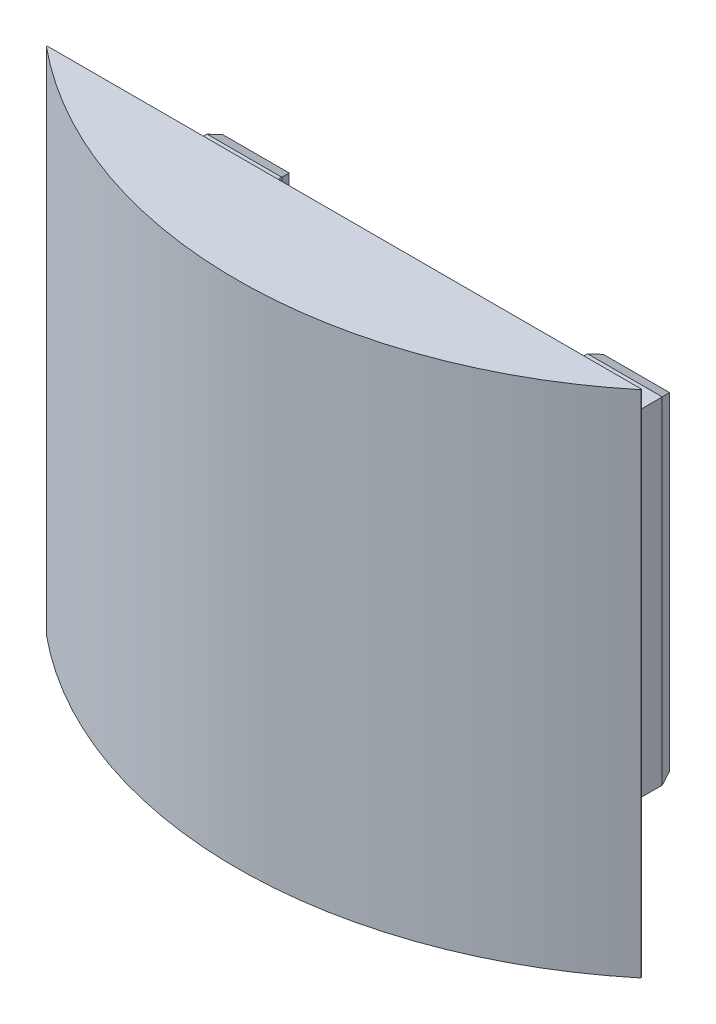
ISO-10303-21;
HEADER;
FILE_DESCRIPTION(('STEP AP214'),'2;1');
FILE_NAME('part.step','',(''),(''),'','','');
FILE_SCHEMA(('AUTOMOTIVE_DESIGN { 1 0 10303 214 1 1 1 1 }'));
ENDSEC;
DATA;
#1=APPLICATION_CONTEXT('core data for automotive mechanical design processes');
#2=APPLICATION_PROTOCOL_DEFINITION('international standard','automotive_design',2000,#1);
#3=PRODUCT_CONTEXT('',#1,'mechanical');
#4=PRODUCT('Part','Part','',(#3));
#5=PRODUCT_RELATED_PRODUCT_CATEGORY('part','',(#4));
#6=PRODUCT_DEFINITION_FORMATION('','',#4);
#7=PRODUCT_DEFINITION_CONTEXT('part definition',#1,'design');
#8=PRODUCT_DEFINITION('design','',#6,#7);
#9=PRODUCT_DEFINITION_SHAPE('','',#8);
#10=(LENGTH_UNIT() NAMED_UNIT(*) SI_UNIT(.MILLI.,.METRE.));
#11=(NAMED_UNIT(*) PLANE_ANGLE_UNIT() SI_UNIT($,.RADIAN.));
#12=(NAMED_UNIT(*) SI_UNIT($,.STERADIAN.) SOLID_ANGLE_UNIT());
#13=UNCERTAINTY_MEASURE_WITH_UNIT(LENGTH_MEASURE(1.E-05),#10,'distance_accuracy_value','');
#14=(GEOMETRIC_REPRESENTATION_CONTEXT(3) GLOBAL_UNCERTAINTY_ASSIGNED_CONTEXT((#13)) GLOBAL_UNIT_ASSIGNED_CONTEXT((#10,
#11,#12)) REPRESENTATION_CONTEXT('',''));
#15=CARTESIAN_POINT('',(0.,0.,0.));
#16=DIRECTION('',(0.,0.,1.));
#17=DIRECTION('',(1.,0.,0.));
#18=AXIS2_PLACEMENT_3D('',#15,#16,#17);
#19=CARTESIAN_POINT('',(26.8,-19.8,12.));
#20=DIRECTION('',(0.,1.,0.));
#21=DIRECTION('',(-1.,0.,0.));
#22=AXIS2_PLACEMENT_3D('',#19,#20,#21);
#23=PLANE('',#22);
#24=CARTESIAN_POINT('',(-22.5,-19.8,4.60000000000001));
#25=DIRECTION('',(0.,1.,0.));
#26=DIRECTION('',(-1.,0.,0.));
#27=AXIS2_PLACEMENT_3D('',#24,#25,#26);
#28=CIRCLE('',#27,2.1);
#29=CARTESIAN_POINT('',(-24.6,-19.8,4.60000000000001));
#30=VERTEX_POINT('',#29);
#31=EDGE_CURVE('E201',#30,#30,#28,.T.);
#32=ORIENTED_EDGE('',*,*,#31,.T.);
#33=EDGE_LOOP('',(#32));
#34=FACE_BOUND('',#33,.T.);
#35=DIRECTION('',(0.,0.,-1.));
#36=VECTOR('',#35,1.);
#37=CARTESIAN_POINT('',(-26.8,-19.8,12.));
#38=LINE('',#37,#36);
#39=CARTESIAN_POINT('',(-26.8,-19.8,12.));
#40=VERTEX_POINT('',#39);
#41=CARTESIAN_POINT('',(-26.8,-19.8,1.37373870972732));
#42=VERTEX_POINT('',#41);
#43=EDGE_CURVE('E246',#40,#42,#38,.T.);
#44=ORIENTED_EDGE('',*,*,#43,.T.);
#45=DIRECTION('',(1.,0.,0.));
#46=VECTOR('',#45,1.);
#47=CARTESIAN_POINT('',(26.8,-19.8,1.37373870972732));
#48=LINE('',#47,#46);
#49=CARTESIAN_POINT('',(-18.,-19.8,1.37373870972732));
#50=VERTEX_POINT('',#49);
#51=EDGE_CURVE('E59',#42,#50,#48,.T.);
#52=ORIENTED_EDGE('',*,*,#51,.T.);
#53=DIRECTION('',(0.,0.,-1.));
#54=VECTOR('',#53,1.);
#55=CARTESIAN_POINT('',(-18.,-19.8,65.5178474903466));
#56=LINE('',#55,#54);
#57=CARTESIAN_POINT('',(-18.,-19.8,12.));
#58=VERTEX_POINT('',#57);
#59=EDGE_CURVE('E190',#58,#50,#56,.T.);
#60=ORIENTED_EDGE('',*,*,#59,.F.);
#61=DIRECTION('',(1.,0.,0.));
#62=VECTOR('',#61,1.);
#63=CARTESIAN_POINT('',(26.8,-19.8,12.));
#64=LINE('',#63,#62);
#65=EDGE_CURVE('E227',#40,#58,#64,.T.);
#66=ORIENTED_EDGE('',*,*,#65,.F.);
#67=EDGE_LOOP('',(#44,#52,#60,#66));
#68=FACE_BOUND('',#67,.T.);
#69=ADVANCED_FACE('F35',(#34,#68),#23,.F.);
#70=CARTESIAN_POINT('',(26.8,19.8,12.));
#71=DIRECTION('',(0.,-1.,0.));
#72=DIRECTION('',(1.,0.,0.));
#73=AXIS2_PLACEMENT_3D('',#70,#71,#72);
#74=PLANE('',#73);
#75=CARTESIAN_POINT('',(-22.5,19.8,4.60000000000001));
#76=DIRECTION('',(0.,1.,0.));
#77=DIRECTION('',(-1.,0.,0.));
#78=AXIS2_PLACEMENT_3D('',#75,#76,#77);
#79=CIRCLE('',#78,2.1);
#80=CARTESIAN_POINT('',(-24.6,19.8,4.60000000000001));
#81=VERTEX_POINT('',#80);
#82=EDGE_CURVE('E198',#81,#81,#79,.T.);
#83=ORIENTED_EDGE('',*,*,#82,.F.);
#84=EDGE_LOOP('',(#83));
#85=FACE_BOUND('',#84,.T.);
#86=DIRECTION('',(0.,0.,-1.));
#87=VECTOR('',#86,1.);
#88=CARTESIAN_POINT('',(-18.,19.8,65.5178474903466));
#89=LINE('',#88,#87);
#90=CARTESIAN_POINT('',(-18.,19.8,12.));
#91=VERTEX_POINT('',#90);
#92=CARTESIAN_POINT('',(-18.,19.8,1.37373870972732));
#93=VERTEX_POINT('',#92);
#94=EDGE_CURVE('E189',#91,#93,#89,.T.);
#95=ORIENTED_EDGE('',*,*,#94,.T.);
#96=DIRECTION('',(-1.,0.,0.));
#97=VECTOR('',#96,1.);
#98=CARTESIAN_POINT('',(26.8,19.8,1.37373870972732));
#99=LINE('',#98,#97);
#100=CARTESIAN_POINT('',(-26.8,19.8,1.37373870972732));
#101=VERTEX_POINT('',#100);
#102=EDGE_CURVE('E11',#93,#101,#99,.T.);
#103=ORIENTED_EDGE('',*,*,#102,.T.);
#104=DIRECTION('',(0.,0.,-1.));
#105=VECTOR('',#104,1.);
#106=CARTESIAN_POINT('',(-26.8,19.8,12.));
#107=LINE('',#106,#105);
#108=CARTESIAN_POINT('',(-26.8,19.8,12.));
#109=VERTEX_POINT('',#108);
#110=EDGE_CURVE('E237',#109,#101,#107,.T.);
#111=ORIENTED_EDGE('',*,*,#110,.F.);
#112=DIRECTION('',(-1.,0.,0.));
#113=VECTOR('',#112,1.);
#114=CARTESIAN_POINT('',(26.8,19.8,12.));
#115=LINE('',#114,#113);
#116=EDGE_CURVE('E233',#91,#109,#115,.T.);
#117=ORIENTED_EDGE('',*,*,#116,.F.);
#118=EDGE_LOOP('',(#95,#103,#111,#117));
#119=FACE_BOUND('',#118,.T.);
#120=ADVANCED_FACE('F321',(#85,#119),#74,.F.);
#121=CARTESIAN_POINT('',(0.,0.,0.));
#122=DIRECTION('',(0.,0.,1.));
#123=DIRECTION('',(1.,0.,0.));
#124=AXIS2_PLACEMENT_3D('',#121,#122,#123);
#125=PLANE('',#124);
#126=DIRECTION('',(-1.,0.,0.));
#127=VECTOR('',#126,1.);
#128=CARTESIAN_POINT('',(0.,-19.3,0.));
#129=LINE('',#128,#127);
#130=CARTESIAN_POINT('',(-18.5,-19.3,0.));
#131=VERTEX_POINT('',#130);
#132=CARTESIAN_POINT('',(-26.3,-19.3,0.));
#133=VERTEX_POINT('',#132);
#134=EDGE_CURVE('E273',#131,#133,#129,.T.);
#135=ORIENTED_EDGE('',*,*,#134,.T.);
#136=DIRECTION('',(0.,1.,0.));
#137=VECTOR('',#136,1.);
#138=CARTESIAN_POINT('',(-26.3,0.,0.));
#139=LINE('',#138,#137);
#140=CARTESIAN_POINT('',(-26.3,19.3,0.));
#141=VERTEX_POINT('',#140);
#142=EDGE_CURVE('E275',#133,#141,#139,.T.);
#143=ORIENTED_EDGE('',*,*,#142,.T.);
#144=DIRECTION('',(1.,0.,0.));
#145=VECTOR('',#144,1.);
#146=CARTESIAN_POINT('',(0.,19.3,0.));
#147=LINE('',#146,#145);
#148=CARTESIAN_POINT('',(-18.5,19.3,0.));
#149=VERTEX_POINT('',#148);
#150=EDGE_CURVE('E269',#141,#149,#147,.T.);
#151=ORIENTED_EDGE('',*,*,#150,.T.);
#152=DIRECTION('',(0.,-1.,0.));
#153=VECTOR('',#152,1.);
#154=CARTESIAN_POINT('',(-18.5,0.,0.));
#155=LINE('',#154,#153);
#156=EDGE_CURVE('E271',#149,#131,#155,.T.);
#157=ORIENTED_EDGE('',*,*,#156,.T.);
#158=EDGE_LOOP('',(#135,#143,#151,#157));
#159=FACE_BOUND('',#158,.T.);
#160=ADVANCED_FACE('F304',(#159),#125,.F.);
#161=CARTESIAN_POINT('',(-26.8,-19.8,12.));
#162=DIRECTION('',(1.,0.,0.));
#163=DIRECTION('',(0.,0.,-1.));
#164=AXIS2_PLACEMENT_3D('',#161,#162,#163);
#165=PLANE('',#164);
#166=ORIENTED_EDGE('',*,*,#110,.T.);
#167=DIRECTION('',(0.,-1.,0.));
#168=VECTOR('',#167,1.);
#169=CARTESIAN_POINT('',(-26.8,-19.8,1.37373870972732));
#170=LINE('',#169,#168);
#171=EDGE_CURVE('E266',#101,#42,#170,.T.);
#172=ORIENTED_EDGE('',*,*,#171,.T.);
#173=ORIENTED_EDGE('',*,*,#43,.F.);
#174=DIRECTION('',(0.,-1.,0.));
#175=VECTOR('',#174,1.);
#176=CARTESIAN_POINT('',(-26.8,-19.8,12.));
#177=LINE('',#176,#175);
#178=EDGE_CURVE('E223',#109,#40,#177,.T.);
#179=ORIENTED_EDGE('',*,*,#178,.F.);
#180=EDGE_LOOP('',(#166,#172,#173,#179));
#181=FACE_BOUND('',#180,.T.);
#182=ADVANCED_FACE('F313',(#181),#165,.F.);
#183=CARTESIAN_POINT('',(22.5,-19.8,4.6));
#184=DIRECTION('',(0.,1.,0.));
#185=DIRECTION('',(-1.,0.,0.));
#186=AXIS2_PLACEMENT_3D('',#183,#184,#185);
#187=CIRCLE('',#186,2.1);
#188=CARTESIAN_POINT('',(20.4,-19.8,4.6));
#189=VERTEX_POINT('',#188);
#190=EDGE_CURVE('E207',#189,#189,#187,.T.);
#191=ORIENTED_EDGE('',*,*,#190,.T.);
#192=EDGE_LOOP('',(#191));
#193=FACE_BOUND('',#192,.T.);
#194=DIRECTION('',(0.,0.,-1.));
#195=VECTOR('',#194,1.);
#196=CARTESIAN_POINT('',(18.,-19.8,65.5178474903466));
#197=LINE('',#196,#195);
#198=CARTESIAN_POINT('',(18.,-19.8,12.));
#199=VERTEX_POINT('',#198);
#200=CARTESIAN_POINT('',(18.,-19.8,1.37373870972732));
#201=VERTEX_POINT('',#200);
#202=EDGE_CURVE('E185',#199,#201,#197,.T.);
#203=ORIENTED_EDGE('',*,*,#202,.T.);
#204=DIRECTION('',(1.,0.,0.));
#205=VECTOR('',#204,1.);
#206=CARTESIAN_POINT('',(26.8,-19.8,1.37373870972732));
#207=LINE('',#206,#205);
#208=CARTESIAN_POINT('',(26.8,-19.8,1.37373870972732));
#209=VERTEX_POINT('',#208);
#210=EDGE_CURVE('E264',#201,#209,#207,.T.);
#211=ORIENTED_EDGE('',*,*,#210,.T.);
#212=DIRECTION('',(0.,0.,-1.));
#213=VECTOR('',#212,1.);
#214=CARTESIAN_POINT('',(26.8,-19.8,12.));
#215=LINE('',#214,#213);
#216=CARTESIAN_POINT('',(26.8,-19.8,12.));
#217=VERTEX_POINT('',#216);
#218=EDGE_CURVE('E243',#217,#209,#215,.T.);
#219=ORIENTED_EDGE('',*,*,#218,.F.);
#220=EDGE_CURVE('E226',#199,#217,#64,.T.);
#221=ORIENTED_EDGE('',*,*,#220,.F.);
#222=EDGE_LOOP('',(#203,#211,#219,#221));
#223=FACE_BOUND('',#222,.T.);
#224=ADVANCED_FACE('F340',(#193,#223),#23,.F.);
#225=CARTESIAN_POINT('',(26.8,-19.8,12.));
#226=DIRECTION('',(-1.,0.,0.));
#227=DIRECTION('',(0.,0.,1.));
#228=AXIS2_PLACEMENT_3D('',#225,#226,#227);
#229=PLANE('',#228);
#230=ORIENTED_EDGE('',*,*,#218,.T.);
#231=DIRECTION('',(0.,1.,0.));
#232=VECTOR('',#231,1.);
#233=CARTESIAN_POINT('',(26.8,-19.8,1.37373870972732));
#234=LINE('',#233,#232);
#235=CARTESIAN_POINT('',(26.8,19.8,1.37373870972732));
#236=VERTEX_POINT('',#235);
#237=EDGE_CURVE('E248',#209,#236,#234,.T.);
#238=ORIENTED_EDGE('',*,*,#237,.T.);
#239=DIRECTION('',(0.,0.,-1.));
#240=VECTOR('',#239,1.);
#241=CARTESIAN_POINT('',(26.8,19.8,12.));
#242=LINE('',#241,#240);
#243=CARTESIAN_POINT('',(26.8,19.8,12.));
#244=VERTEX_POINT('',#243);
#245=EDGE_CURVE('E240',#244,#236,#242,.T.);
#246=ORIENTED_EDGE('',*,*,#245,.F.);
#247=DIRECTION('',(0.,1.,0.));
#248=VECTOR('',#247,1.);
#249=CARTESIAN_POINT('',(26.8,-19.8,12.));
#250=LINE('',#249,#248);
#251=EDGE_CURVE('E230',#217,#244,#250,.T.);
#252=ORIENTED_EDGE('',*,*,#251,.F.);
#253=EDGE_LOOP('',(#230,#238,#246,#252));
#254=FACE_BOUND('',#253,.T.);
#255=ADVANCED_FACE('F350',(#254),#229,.F.);
#256=CARTESIAN_POINT('',(22.5,19.8,4.6));
#257=DIRECTION('',(0.,1.,0.));
#258=DIRECTION('',(-1.,0.,0.));
#259=AXIS2_PLACEMENT_3D('',#256,#257,#258);
#260=CIRCLE('',#259,2.1);
#261=CARTESIAN_POINT('',(20.4,19.8,4.6));
#262=VERTEX_POINT('',#261);
#263=EDGE_CURVE('E204',#262,#262,#260,.T.);
#264=ORIENTED_EDGE('',*,*,#263,.F.);
#265=EDGE_LOOP('',(#264));
#266=FACE_BOUND('',#265,.T.);
#267=ORIENTED_EDGE('',*,*,#245,.T.);
#268=DIRECTION('',(-1.,0.,0.));
#269=VECTOR('',#268,1.);
#270=CARTESIAN_POINT('',(26.8,19.8,1.37373870972732));
#271=LINE('',#270,#269);
#272=CARTESIAN_POINT('',(18.,19.8,1.37373870972732));
#273=VERTEX_POINT('',#272);
#274=EDGE_CURVE('E260',#236,#273,#271,.T.);
#275=ORIENTED_EDGE('',*,*,#274,.T.);
#276=DIRECTION('',(0.,0.,-1.));
#277=VECTOR('',#276,1.);
#278=CARTESIAN_POINT('',(18.,19.8,65.5178474903466));
#279=LINE('',#278,#277);
#280=CARTESIAN_POINT('',(18.,19.8,12.));
#281=VERTEX_POINT('',#280);
#282=EDGE_CURVE('E186',#281,#273,#279,.T.);
#283=ORIENTED_EDGE('',*,*,#282,.F.);
#284=EDGE_CURVE('E234',#244,#281,#115,.T.);
#285=ORIENTED_EDGE('',*,*,#284,.F.);
#286=EDGE_LOOP('',(#267,#275,#283,#285));
#287=FACE_BOUND('',#286,.T.);
#288=ADVANCED_FACE('F346',(#266,#287),#74,.F.);
#289=DIRECTION('',(1.,0.,0.));
#290=VECTOR('',#289,1.);
#291=CARTESIAN_POINT('',(0.,19.3,0.));
#292=LINE('',#291,#290);
#293=CARTESIAN_POINT('',(18.5,19.3,0.));
#294=VERTEX_POINT('',#293);
#295=CARTESIAN_POINT('',(26.3,19.3,0.));
#296=VERTEX_POINT('',#295);
#297=EDGE_CURVE('E255',#294,#296,#292,.T.);
#298=ORIENTED_EDGE('',*,*,#297,.T.);
#299=DIRECTION('',(0.,-1.,0.));
#300=VECTOR('',#299,1.);
#301=CARTESIAN_POINT('',(26.3,0.,0.));
#302=LINE('',#301,#300);
#303=CARTESIAN_POINT('',(26.3,-19.3,0.));
#304=VERTEX_POINT('',#303);
#305=EDGE_CURVE('E257',#296,#304,#302,.T.);
#306=ORIENTED_EDGE('',*,*,#305,.T.);
#307=DIRECTION('',(-1.,0.,0.));
#308=VECTOR('',#307,1.);
#309=CARTESIAN_POINT('',(0.,-19.3,0.));
#310=LINE('',#309,#308);
#311=CARTESIAN_POINT('',(18.5,-19.3,0.));
#312=VERTEX_POINT('',#311);
#313=EDGE_CURVE('E251',#304,#312,#310,.T.);
#314=ORIENTED_EDGE('',*,*,#313,.T.);
#315=DIRECTION('',(0.,1.,0.));
#316=VECTOR('',#315,1.);
#317=CARTESIAN_POINT('',(18.5,0.,0.));
#318=LINE('',#317,#316);
#319=EDGE_CURVE('E253',#312,#294,#318,.T.);
#320=ORIENTED_EDGE('',*,*,#319,.T.);
#321=EDGE_LOOP('',(#298,#306,#314,#320));
#322=FACE_BOUND('',#321,.T.);
#323=ADVANCED_FACE('F385',(#322),#125,.F.);
#324=CARTESIAN_POINT('',(0.,0.,12.));
#325=DIRECTION('',(0.,0.,1.));
#326=DIRECTION('',(1.,0.,0.));
#327=AXIS2_PLACEMENT_3D('',#324,#325,#326);
#328=PLANE('',#327);
#329=ORIENTED_EDGE('',*,*,#65,.T.);
#330=DIRECTION('',(0.,1.,0.));
#331=VECTOR('',#330,1.);
#332=CARTESIAN_POINT('',(-18.,-19.8,12.));
#333=LINE('',#332,#331);
#334=EDGE_CURVE('E187',#58,#91,#333,.T.);
#335=ORIENTED_EDGE('',*,*,#334,.T.);
#336=ORIENTED_EDGE('',*,*,#116,.T.);
#337=ORIENTED_EDGE('',*,*,#178,.T.);
#338=EDGE_LOOP('',(#329,#335,#336,#337));
#339=FACE_BOUND('',#338,.T.);
#340=DIRECTION('',(0.,-1.,0.));
#341=VECTOR('',#340,1.);
#342=CARTESIAN_POINT('',(-35.,-30.,12.));
#343=LINE('',#342,#341);
#344=CARTESIAN_POINT('',(-35.,30.,12.));
#345=VERTEX_POINT('',#344);
#346=CARTESIAN_POINT('',(-35.,-30.,12.));
#347=VERTEX_POINT('',#346);
#348=EDGE_CURVE('E210',#345,#347,#343,.T.);
#349=ORIENTED_EDGE('',*,*,#348,.F.);
#350=DIRECTION('',(-1.,0.,0.));
#351=VECTOR('',#350,1.);
#352=CARTESIAN_POINT('',(35.,30.,12.));
#353=LINE('',#352,#351);
#354=CARTESIAN_POINT('',(35.,30.,12.));
#355=VERTEX_POINT('',#354);
#356=EDGE_CURVE('E211',#355,#345,#353,.T.);
#357=ORIENTED_EDGE('',*,*,#356,.F.);
#358=DIRECTION('',(0.,1.,0.));
#359=VECTOR('',#358,1.);
#360=CARTESIAN_POINT('',(35.,-30.,12.));
#361=LINE('',#360,#359);
#362=CARTESIAN_POINT('',(35.,-30.,12.));
#363=VERTEX_POINT('',#362);
#364=EDGE_CURVE('E216',#363,#355,#361,.T.);
#365=ORIENTED_EDGE('',*,*,#364,.F.);
#366=DIRECTION('',(1.,0.,0.));
#367=VECTOR('',#366,1.);
#368=CARTESIAN_POINT('',(35.,-30.,12.));
#369=LINE('',#368,#367);
#370=EDGE_CURVE('E171',#347,#363,#369,.T.);
#371=ORIENTED_EDGE('',*,*,#370,.F.);
#372=EDGE_LOOP('',(#349,#357,#365,#371));
#373=FACE_BOUND('',#372,.T.);
#374=ORIENTED_EDGE('',*,*,#284,.T.);
#375=DIRECTION('',(0.,-1.,0.));
#376=VECTOR('',#375,1.);
#377=CARTESIAN_POINT('',(18.,-19.8,12.));
#378=LINE('',#377,#376);
#379=EDGE_CURVE('E183',#281,#199,#378,.T.);
#380=ORIENTED_EDGE('',*,*,#379,.T.);
#381=ORIENTED_EDGE('',*,*,#220,.T.);
#382=ORIENTED_EDGE('',*,*,#251,.T.);
#383=EDGE_LOOP('',(#374,#380,#381,#382));
#384=FACE_BOUND('',#383,.T.);
#385=ADVANCED_FACE('F317',(#339,#373,#384),#328,.F.);
#386=CARTESIAN_POINT('',(-35.,-30.,12.1));
#387=DIRECTION('',(1.,0.,0.));
#388=DIRECTION('',(0.,1.,0.));
#389=AXIS2_PLACEMENT_3D('',#386,#387,#388);
#390=PLANE('',#389);
#391=ORIENTED_EDGE('',*,*,#348,.T.);
#392=DIRECTION('',(0.,0.,-1.));
#393=VECTOR('',#392,1.);
#394=CARTESIAN_POINT('',(-35.,-30.,12.1));
#395=LINE('',#394,#393);
#396=CARTESIAN_POINT('',(-35.,-30.,12.1));
#397=VERTEX_POINT('',#396);
#398=EDGE_CURVE('E172',#397,#347,#395,.T.);
#399=ORIENTED_EDGE('',*,*,#398,.F.);
#400=DIRECTION('',(0.,-1.,0.));
#401=VECTOR('',#400,1.);
#402=CARTESIAN_POINT('',(-35.,-30.,12.1));
#403=LINE('',#402,#401);
#404=CARTESIAN_POINT('',(-35.,30.,12.1));
#405=VERTEX_POINT('',#404);
#406=EDGE_CURVE('E163',#405,#397,#403,.T.);
#407=ORIENTED_EDGE('',*,*,#406,.F.);
#408=DIRECTION('',(0.,0.,-1.));
#409=VECTOR('',#408,1.);
#410=CARTESIAN_POINT('',(-35.,30.,12.1));
#411=LINE('',#410,#409);
#412=EDGE_CURVE('E162',#405,#345,#411,.T.);
#413=ORIENTED_EDGE('',*,*,#412,.T.);
#414=EDGE_LOOP('',(#391,#399,#407,#413));
#415=FACE_BOUND('',#414,.T.);
#416=ADVANCED_FACE('F384',(#415),#390,.F.);
#417=CARTESIAN_POINT('',(35.,-30.,12.1));
#418=DIRECTION('',(0.,1.,0.));
#419=DIRECTION('',(0.,0.,1.));
#420=AXIS2_PLACEMENT_3D('',#417,#418,#419);
#421=PLANE('',#420);
#422=ORIENTED_EDGE('',*,*,#370,.T.);
#423=DIRECTION('',(0.,0.,-1.));
#424=VECTOR('',#423,1.);
#425=CARTESIAN_POINT('',(35.,-30.,12.1));
#426=LINE('',#425,#424);
#427=CARTESIAN_POINT('',(35.,-30.,12.1));
#428=VERTEX_POINT('',#427);
#429=EDGE_CURVE('E154',#428,#363,#426,.T.);
#430=ORIENTED_EDGE('',*,*,#429,.F.);
#431=CARTESIAN_POINT('',(0.,-30.,-30.3264068711928));
#432=DIRECTION('',(0.,1.,0.));
#433=DIRECTION('',(0.,0.,1.));
#434=AXIS2_PLACEMENT_3D('',#431,#432,#433);
#435=CIRCLE('',#434,55.);
#436=EDGE_CURVE('E169',#428,#397,#435,.F.);
#437=ORIENTED_EDGE('',*,*,#436,.T.);
#438=ORIENTED_EDGE('',*,*,#398,.T.);
#439=EDGE_LOOP('',(#422,#430,#437,#438));
#440=FACE_BOUND('',#439,.T.);
#441=ADVANCED_FACE('F167',(#440),#421,.F.);
#442=CARTESIAN_POINT('',(35.,-30.,12.1));
#443=DIRECTION('',(-1.,0.,0.));
#444=DIRECTION('',(0.,0.,1.));
#445=AXIS2_PLACEMENT_3D('',#442,#443,#444);
#446=PLANE('',#445);
#447=ORIENTED_EDGE('',*,*,#364,.T.);
#448=DIRECTION('',(0.,0.,-1.));
#449=VECTOR('',#448,1.);
#450=CARTESIAN_POINT('',(35.,30.,12.1));
#451=LINE('',#450,#449);
#452=CARTESIAN_POINT('',(35.,30.,12.1));
#453=VERTEX_POINT('',#452);
#454=EDGE_CURVE('E157',#453,#355,#451,.T.);
#455=ORIENTED_EDGE('',*,*,#454,.F.);
#456=DIRECTION('',(0.,1.,0.));
#457=VECTOR('',#456,1.);
#458=CARTESIAN_POINT('',(35.,-30.,12.1));
#459=LINE('',#458,#457);
#460=EDGE_CURVE('E151',#428,#453,#459,.T.);
#461=ORIENTED_EDGE('',*,*,#460,.F.);
#462=ORIENTED_EDGE('',*,*,#429,.T.);
#463=EDGE_LOOP('',(#447,#455,#461,#462));
#464=FACE_BOUND('',#463,.T.);
#465=ADVANCED_FACE('F153',(#464),#446,.F.);
#466=CARTESIAN_POINT('',(35.,30.,12.1));
#467=DIRECTION('',(0.,-1.,0.));
#468=DIRECTION('',(0.,0.,-1.));
#469=AXIS2_PLACEMENT_3D('',#466,#467,#468);
#470=PLANE('',#469);
#471=ORIENTED_EDGE('',*,*,#356,.T.);
#472=ORIENTED_EDGE('',*,*,#412,.F.);
#473=CARTESIAN_POINT('',(0.,30.,-30.3264068711928));
#474=DIRECTION('',(0.,1.,0.));
#475=DIRECTION('',(0.,0.,-1.));
#476=AXIS2_PLACEMENT_3D('',#473,#474,#475);
#477=CIRCLE('',#476,55.);
#478=EDGE_CURVE('E177',#405,#453,#477,.T.);
#479=ORIENTED_EDGE('',*,*,#478,.T.);
#480=ORIENTED_EDGE('',*,*,#454,.T.);
#481=EDGE_LOOP('',(#471,#472,#479,#480));
#482=FACE_BOUND('',#481,.T.);
#483=ADVANCED_FACE('F397',(#482),#470,.F.);
#484=CARTESIAN_POINT('',(22.5,-30.,4.6));
#485=DIRECTION('',(0.,1.,0.));
#486=DIRECTION('',(-1.,0.,0.));
#487=AXIS2_PLACEMENT_3D('',#484,#485,#486);
#488=CYLINDRICAL_SURFACE('',#487,2.1);
#489=ORIENTED_EDGE('',*,*,#263,.T.);
#490=EDGE_LOOP('',(#489));
#491=FACE_BOUND('',#490,.T.);
#492=ORIENTED_EDGE('',*,*,#190,.F.);
#493=EDGE_LOOP('',(#492));
#494=FACE_BOUND('',#493,.T.);
#495=ADVANCED_FACE('F334',(#491,#494),#488,.F.);
#496=CARTESIAN_POINT('',(-22.5,-30.,4.60000000000001));
#497=DIRECTION('',(0.,1.,0.));
#498=DIRECTION('',(-1.,0.,0.));
#499=AXIS2_PLACEMENT_3D('',#496,#497,#498);
#500=CYLINDRICAL_SURFACE('',#499,2.1);
#501=ORIENTED_EDGE('',*,*,#82,.T.);
#502=EDGE_LOOP('',(#501));
#503=FACE_BOUND('',#502,.T.);
#504=ORIENTED_EDGE('',*,*,#31,.F.);
#505=EDGE_LOOP('',(#504));
#506=FACE_BOUND('',#505,.T.);
#507=ADVANCED_FACE('F325',(#503,#506),#500,.F.);
#508=CARTESIAN_POINT('',(-18.,-19.8,65.5178474903466));
#509=DIRECTION('',(-1.,0.,0.));
#510=DIRECTION('',(0.,0.,1.));
#511=AXIS2_PLACEMENT_3D('',#508,#509,#510);
#512=PLANE('',#511);
#513=ORIENTED_EDGE('',*,*,#59,.T.);
#514=DIRECTION('',(0.,1.,0.));
#515=VECTOR('',#514,1.);
#516=CARTESIAN_POINT('',(-18.,-19.8,1.37373870972732));
#517=LINE('',#516,#515);
#518=EDGE_CURVE('E44',#50,#93,#517,.T.);
#519=ORIENTED_EDGE('',*,*,#518,.T.);
#520=ORIENTED_EDGE('',*,*,#94,.F.);
#521=ORIENTED_EDGE('',*,*,#334,.F.);
#522=EDGE_LOOP('',(#513,#519,#520,#521));
#523=FACE_BOUND('',#522,.T.);
#524=ADVANCED_FACE('F322',(#523),#512,.F.);
#525=CARTESIAN_POINT('',(18.,-19.8,65.5178474903466));
#526=DIRECTION('',(1.,0.,0.));
#527=DIRECTION('',(0.,0.,-1.));
#528=AXIS2_PLACEMENT_3D('',#525,#526,#527);
#529=PLANE('',#528);
#530=ORIENTED_EDGE('',*,*,#282,.T.);
#531=DIRECTION('',(0.,-1.,0.));
#532=VECTOR('',#531,1.);
#533=CARTESIAN_POINT('',(18.,-19.8,1.37373870972732));
#534=LINE('',#533,#532);
#535=EDGE_CURVE('E262',#273,#201,#534,.T.);
#536=ORIENTED_EDGE('',*,*,#535,.T.);
#537=ORIENTED_EDGE('',*,*,#202,.F.);
#538=ORIENTED_EDGE('',*,*,#379,.F.);
#539=EDGE_LOOP('',(#530,#536,#537,#538));
#540=FACE_BOUND('',#539,.T.);
#541=ADVANCED_FACE('F324',(#540),#529,.F.);
#542=CARTESIAN_POINT('',(18.,-19.8,1.37373870972732));
#543=DIRECTION('',(0.939692620785909,0.,0.342020143325667));
#544=DIRECTION('',(0.,-1.,0.));
#545=AXIS2_PLACEMENT_3D('',#542,#543,#544);
#546=PLANE('',#545);
#547=DIRECTION('',(0.323615577118184,-0.323615577118184,-0.889126490715989));
#548=VECTOR('',#547,1.);
#549=CARTESIAN_POINT('',(22.14719085344,15.65280914656,-10.0205745142678));
#550=LINE('',#549,#548);
#551=EDGE_CURVE('E284',#294,#273,#550,.F.);
#552=ORIENTED_EDGE('',*,*,#551,.F.);
#553=ORIENTED_EDGE('',*,*,#319,.F.);
#554=DIRECTION('',(0.323615577118184,0.323615577118184,-0.889126490715989));
#555=VECTOR('',#554,1.);
#556=CARTESIAN_POINT('',(18.9215979674311,-18.8784020325689,-1.15833089560494));
#557=LINE('',#556,#555);
#558=EDGE_CURVE('E195',#201,#312,#557,.T.);
#559=ORIENTED_EDGE('',*,*,#558,.F.);
#560=ORIENTED_EDGE('',*,*,#535,.F.);
#561=EDGE_LOOP('',(#552,#553,#559,#560));
#562=FACE_BOUND('',#561,.T.);
#563=ADVANCED_FACE('F331',(#562),#546,.F.);
#564=CARTESIAN_POINT('',(26.8,-19.8,1.37373870972732));
#565=DIRECTION('',(0.,0.939692620785909,0.342020143325667));
#566=DIRECTION('',(1.,0.,0.));
#567=AXIS2_PLACEMENT_3D('',#564,#565,#566);
#568=PLANE('',#567);
#569=ORIENTED_EDGE('',*,*,#558,.T.);
#570=ORIENTED_EDGE('',*,*,#313,.F.);
#571=DIRECTION('',(0.323615577118184,-0.323615577118184,0.889126490715989));
#572=VECTOR('',#571,1.);
#573=CARTESIAN_POINT('',(26.8,-19.8,1.37373870972732));
#574=LINE('',#573,#572);
#575=EDGE_CURVE('E282',#209,#304,#574,.F.);
#576=ORIENTED_EDGE('',*,*,#575,.F.);
#577=ORIENTED_EDGE('',*,*,#210,.F.);
#578=EDGE_LOOP('',(#569,#570,#576,#577));
#579=FACE_BOUND('',#578,.T.);
#580=ADVANCED_FACE('F371',(#579),#568,.F.);
#581=CARTESIAN_POINT('',(26.8,19.8,1.37373870972732));
#582=DIRECTION('',(0.,-0.939692620785909,0.342020143325667));
#583=DIRECTION('',(-1.,0.,0.));
#584=AXIS2_PLACEMENT_3D('',#581,#582,#583);
#585=PLANE('',#584);
#586=ORIENTED_EDGE('',*,*,#551,.T.);
#587=ORIENTED_EDGE('',*,*,#274,.F.);
#588=DIRECTION('',(-0.323615577118184,-0.323615577118184,-0.889126490715989));
#589=VECTOR('',#588,1.);
#590=CARTESIAN_POINT('',(26.8,19.8,1.37373870972732));
#591=LINE('',#590,#589);
#592=EDGE_CURVE('E280',#296,#236,#591,.F.);
#593=ORIENTED_EDGE('',*,*,#592,.F.);
#594=ORIENTED_EDGE('',*,*,#297,.F.);
#595=EDGE_LOOP('',(#586,#587,#593,#594));
#596=FACE_BOUND('',#595,.T.);
#597=ADVANCED_FACE('F495',(#596),#585,.F.);
#598=CARTESIAN_POINT('',(26.8,-19.8,1.37373870972732));
#599=DIRECTION('',(-0.939692620785909,0.,0.342020143325667));
#600=DIRECTION('',(0.,1.,0.));
#601=AXIS2_PLACEMENT_3D('',#598,#599,#600);
#602=PLANE('',#601);
#603=ORIENTED_EDGE('',*,*,#575,.T.);
#604=ORIENTED_EDGE('',*,*,#305,.F.);
#605=ORIENTED_EDGE('',*,*,#592,.T.);
#606=ORIENTED_EDGE('',*,*,#237,.F.);
#607=EDGE_LOOP('',(#603,#604,#605,#606));
#608=FACE_BOUND('',#607,.T.);
#609=ADVANCED_FACE('F375',(#608),#602,.F.);
#610=CARTESIAN_POINT('',(-18.,-19.8,1.37373870972732));
#611=DIRECTION('',(-0.939692620785909,0.,0.342020143325667));
#612=DIRECTION('',(0.,1.,0.));
#613=AXIS2_PLACEMENT_3D('',#610,#611,#612);
#614=PLANE('',#613);
#615=DIRECTION('',(-0.323615577118184,0.323615577118184,-0.889126490715989));
#616=VECTOR('',#615,1.);
#617=CARTESIAN_POINT('',(-18.,-19.8,1.37373870972732));
#618=LINE('',#617,#616);
#619=EDGE_CURVE('E289',#131,#50,#618,.F.);
#620=ORIENTED_EDGE('',*,*,#619,.F.);
#621=ORIENTED_EDGE('',*,*,#156,.F.);
#622=DIRECTION('',(-0.323615577118184,-0.323615577118184,-0.889126490715989));
#623=VECTOR('',#622,1.);
#624=CARTESIAN_POINT('',(-13.3082285294416,24.4917714705584,14.2642748823279));
#625=LINE('',#624,#623);
#626=EDGE_CURVE('E39',#93,#149,#625,.T.);
#627=ORIENTED_EDGE('',*,*,#626,.F.);
#628=ORIENTED_EDGE('',*,*,#518,.F.);
#629=EDGE_LOOP('',(#620,#621,#627,#628));
#630=FACE_BOUND('',#629,.T.);
#631=ADVANCED_FACE('F37',(#630),#614,.F.);
#632=CARTESIAN_POINT('',(26.8,19.8,1.37373870972732));
#633=DIRECTION('',(0.,-0.939692620785909,0.342020143325667));
#634=DIRECTION('',(-1.,0.,0.));
#635=AXIS2_PLACEMENT_3D('',#632,#633,#634);
#636=PLANE('',#635);
#637=ORIENTED_EDGE('',*,*,#626,.T.);
#638=ORIENTED_EDGE('',*,*,#150,.F.);
#639=DIRECTION('',(-0.323615577118184,0.323615577118184,0.889126490715989));
#640=VECTOR('',#639,1.);
#641=CARTESIAN_POINT('',(-21.1866305620105,14.1866305620105,-14.0488670682055));
#642=LINE('',#641,#640);
#643=EDGE_CURVE('E179',#101,#141,#642,.F.);
#644=ORIENTED_EDGE('',*,*,#643,.F.);
#645=ORIENTED_EDGE('',*,*,#102,.F.);
#646=EDGE_LOOP('',(#637,#638,#644,#645));
#647=FACE_BOUND('',#646,.T.);
#648=ADVANCED_FACE('F299',(#647),#636,.F.);
#649=CARTESIAN_POINT('',(26.8,-19.8,1.37373870972732));
#650=DIRECTION('',(0.,0.939692620785909,0.342020143325667));
#651=DIRECTION('',(1.,0.,0.));
#652=AXIS2_PLACEMENT_3D('',#649,#650,#651);
#653=PLANE('',#652);
#654=ORIENTED_EDGE('',*,*,#619,.T.);
#655=ORIENTED_EDGE('',*,*,#51,.F.);
#656=DIRECTION('',(0.323615577118184,0.323615577118184,-0.889126490715989));
#657=VECTOR('',#656,1.);
#658=CARTESIAN_POINT('',(-21.1866305620105,-14.1866305620105,-14.0488670682055));
#659=LINE('',#658,#657);
#660=EDGE_CURVE('E176',#133,#42,#659,.F.);
#661=ORIENTED_EDGE('',*,*,#660,.F.);
#662=ORIENTED_EDGE('',*,*,#134,.F.);
#663=EDGE_LOOP('',(#654,#655,#661,#662));
#664=FACE_BOUND('',#663,.T.);
#665=ADVANCED_FACE('F310',(#664),#653,.F.);
#666=CARTESIAN_POINT('',(-26.8,-19.8,1.37373870972732));
#667=DIRECTION('',(0.939692620785909,0.,0.342020143325667));
#668=DIRECTION('',(0.,-1.,0.));
#669=AXIS2_PLACEMENT_3D('',#666,#667,#668);
#670=PLANE('',#669);
#671=ORIENTED_EDGE('',*,*,#643,.T.);
#672=ORIENTED_EDGE('',*,*,#142,.F.);
#673=ORIENTED_EDGE('',*,*,#660,.T.);
#674=ORIENTED_EDGE('',*,*,#171,.F.);
#675=EDGE_LOOP('',(#671,#672,#673,#674));
#676=FACE_BOUND('',#675,.T.);
#677=ADVANCED_FACE('F308',(#676),#670,.F.);
#678=CARTESIAN_POINT('',(0.,-101.120287149088,-30.3264068711928));
#679=DIRECTION('',(0.,1.,0.));
#680=DIRECTION('',(0.,0.,1.));
#681=AXIS2_PLACEMENT_3D('',#678,#679,#680);
#682=CYLINDRICAL_SURFACE('',#681,55.);
#683=ORIENTED_EDGE('',*,*,#436,.F.);
#684=ORIENTED_EDGE('',*,*,#460,.T.);
#685=ORIENTED_EDGE('',*,*,#478,.F.);
#686=ORIENTED_EDGE('',*,*,#406,.T.);
#687=EDGE_LOOP('',(#683,#684,#685,#686));
#688=FACE_BOUND('',#687,.T.);
#689=ADVANCED_FACE('F174',(#688),#682,.T.);
#690=CLOSED_SHELL('',(#69,#120,#160,#182,#224,#255,#288,#323,#385,#416,#441,#465,#483,#495,#507,
#524,#541,#563,#580,#597,#609,#631,#648,#665,#677,#689));
#691=MANIFOLD_SOLID_BREP('B2',#690);
#692=ADVANCED_BREP_SHAPE_REPRESENTATION('',(#18,#691),#14);
#693=SHAPE_DEFINITION_REPRESENTATION(#9,#692);
ENDSEC;
END-ISO-10303-21;
